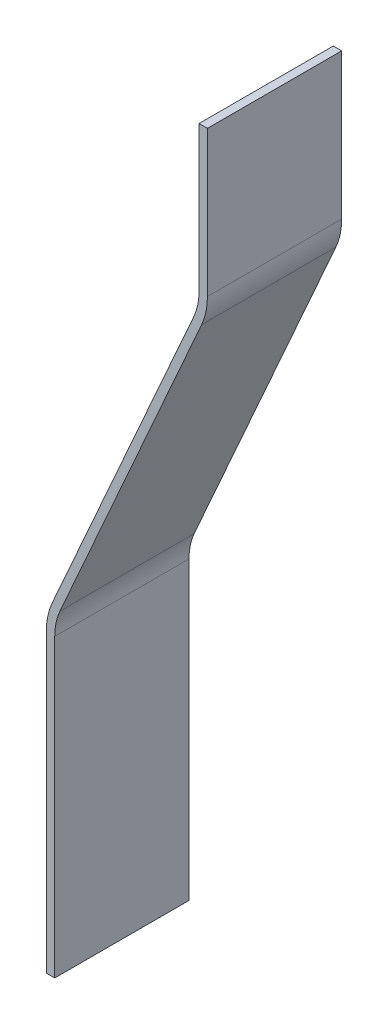
ISO-10303-21;
HEADER;
FILE_DESCRIPTION(('STEP AP214'),'2;1');
FILE_NAME('part.step','',(''),(''),'','','');
FILE_SCHEMA(('AUTOMOTIVE_DESIGN { 1 0 10303 214 1 1 1 1 }'));
ENDSEC;
DATA;
#1=APPLICATION_CONTEXT('core data for automotive mechanical design processes');
#2=APPLICATION_PROTOCOL_DEFINITION('international standard','automotive_design',2000,#1);
#3=PRODUCT_CONTEXT('',#1,'mechanical');
#4=PRODUCT('Part','Part','',(#3));
#5=PRODUCT_RELATED_PRODUCT_CATEGORY('part','',(#4));
#6=PRODUCT_DEFINITION_FORMATION('','',#4);
#7=PRODUCT_DEFINITION_CONTEXT('part definition',#1,'design');
#8=PRODUCT_DEFINITION('design','',#6,#7);
#9=PRODUCT_DEFINITION_SHAPE('','',#8);
#10=(LENGTH_UNIT() NAMED_UNIT(*) SI_UNIT(.MILLI.,.METRE.));
#11=(NAMED_UNIT(*) PLANE_ANGLE_UNIT() SI_UNIT($,.RADIAN.));
#12=(NAMED_UNIT(*) SI_UNIT($,.STERADIAN.) SOLID_ANGLE_UNIT());
#13=UNCERTAINTY_MEASURE_WITH_UNIT(LENGTH_MEASURE(1.E-05),#10,'distance_accuracy_value','');
#14=(GEOMETRIC_REPRESENTATION_CONTEXT(3) GLOBAL_UNCERTAINTY_ASSIGNED_CONTEXT((#13)) GLOBAL_UNIT_ASSIGNED_CONTEXT((#10,
#11,#12)) REPRESENTATION_CONTEXT('',''));
#15=CARTESIAN_POINT('',(0.,0.,0.));
#16=DIRECTION('',(0.,0.,1.));
#17=DIRECTION('',(1.,0.,0.));
#18=AXIS2_PLACEMENT_3D('',#15,#16,#17);
#19=CARTESIAN_POINT('',(0.,-234.95,101.6));
#20=DIRECTION('',(0.,1.,0.));
#21=DIRECTION('',(0.,0.,1.));
#22=AXIS2_PLACEMENT_3D('',#19,#20,#21);
#23=PLANE('',#22);
#24=DIRECTION('',(1.,0.,0.));
#25=VECTOR('',#24,1.);
#26=CARTESIAN_POINT('',(0.,-234.95,0.));
#27=LINE('',#26,#25);
#28=CARTESIAN_POINT('',(0.,-234.95,0.));
#29=VERTEX_POINT('',#28);
#30=CARTESIAN_POINT('',(6.35000000000003,-234.95,0.));
#31=VERTEX_POINT('',#30);
#32=EDGE_CURVE('E169',#29,#31,#27,.T.);
#33=ORIENTED_EDGE('',*,*,#32,.T.);
#34=DIRECTION('',(0.,0.,-1.));
#35=VECTOR('',#34,1.);
#36=CARTESIAN_POINT('',(6.35000000000003,-234.95,101.6));
#37=LINE('',#36,#35);
#38=CARTESIAN_POINT('',(6.35000000000003,-234.95,101.6));
#39=VERTEX_POINT('',#38);
#40=EDGE_CURVE('E11',#39,#31,#37,.T.);
#41=ORIENTED_EDGE('',*,*,#40,.F.);
#42=DIRECTION('',(1.,0.,0.));
#43=VECTOR('',#42,1.);
#44=CARTESIAN_POINT('',(0.,-234.95,101.6));
#45=LINE('',#44,#43);
#46=CARTESIAN_POINT('',(0.,-234.95,101.6));
#47=VERTEX_POINT('',#46);
#48=EDGE_CURVE('E203',#47,#39,#45,.T.);
#49=ORIENTED_EDGE('',*,*,#48,.F.);
#50=DIRECTION('',(0.,0.,-1.));
#51=VECTOR('',#50,1.);
#52=CARTESIAN_POINT('',(0.,-234.95,101.6));
#53=LINE('',#52,#51);
#54=EDGE_CURVE('E165',#47,#29,#53,.T.);
#55=ORIENTED_EDGE('',*,*,#54,.T.);
#56=EDGE_LOOP('',(#33,#41,#49,#55));
#57=FACE_BOUND('',#56,.T.);
#58=ADVANCED_FACE('F44',(#57),#23,.F.);
#59=CARTESIAN_POINT('',(6.35000000000003,-234.95,101.6));
#60=DIRECTION('',(-1.,0.,0.));
#61=DIRECTION('',(0.,-1.,0.));
#62=AXIS2_PLACEMENT_3D('',#59,#60,#61);
#63=PLANE('',#62);
#64=DIRECTION('',(0.,1.,0.));
#65=VECTOR('',#64,1.);
#66=CARTESIAN_POINT('',(6.35000000000003,-234.95,0.));
#67=LINE('',#66,#65);
#68=CARTESIAN_POINT('',(6.35000000000002,-11.046666411209,0.));
#69=VERTEX_POINT('',#68);
#70=EDGE_CURVE('E173',#31,#69,#67,.T.);
#71=ORIENTED_EDGE('',*,*,#70,.T.);
#72=DIRECTION('',(0.,0.,-1.));
#73=VECTOR('',#72,1.);
#74=CARTESIAN_POINT('',(6.35000000000002,-11.046666411209,101.6));
#75=LINE('',#74,#73);
#76=CARTESIAN_POINT('',(6.35000000000002,-11.046666411209,101.6));
#77=VERTEX_POINT('',#76);
#78=EDGE_CURVE('E53',#77,#69,#75,.T.);
#79=ORIENTED_EDGE('',*,*,#78,.F.);
#80=DIRECTION('',(0.,1.,0.));
#81=VECTOR('',#80,1.);
#82=CARTESIAN_POINT('',(6.35000000000003,-234.95,101.6));
#83=LINE('',#82,#81);
#84=EDGE_CURVE('E116',#39,#77,#83,.T.);
#85=ORIENTED_EDGE('',*,*,#84,.F.);
#86=ORIENTED_EDGE('',*,*,#40,.T.);
#87=EDGE_LOOP('',(#71,#79,#85,#86));
#88=FACE_BOUND('',#87,.T.);
#89=ADVANCED_FACE('F297',(#88),#63,.F.);
#90=CARTESIAN_POINT('',(52.07,-11.046666411209,101.6));
#91=DIRECTION('',(0.,0.,-1.));
#92=DIRECTION('',(-1.,0.,0.));
#93=AXIS2_PLACEMENT_3D('',#90,#91,#92);
#94=CYLINDRICAL_SURFACE('',#93,45.72);
#95=CARTESIAN_POINT('',(52.07,-11.046666411209,0.));
#96=DIRECTION('',(0.,0.,-1.));
#97=DIRECTION('',(-1.,0.,0.));
#98=AXIS2_PLACEMENT_3D('',#95,#96,#97);
#99=CIRCLE('',#98,45.72);
#100=CARTESIAN_POINT('',(10.2882567723137,7.51685515275333,0.));
#101=VERTEX_POINT('',#100);
#102=EDGE_CURVE('E176',#69,#101,#99,.T.);
#103=ORIENTED_EDGE('',*,*,#102,.T.);
#104=DIRECTION('',(0.,0.,-1.));
#105=VECTOR('',#104,1.);
#106=CARTESIAN_POINT('',(10.2882567723137,7.51685515275333,101.6));
#107=LINE('',#106,#105);
#108=CARTESIAN_POINT('',(10.2882567723137,7.51685515275333,101.6));
#109=VERTEX_POINT('',#108);
#110=EDGE_CURVE('E230',#109,#101,#107,.T.);
#111=ORIENTED_EDGE('',*,*,#110,.F.);
#112=CARTESIAN_POINT('',(52.07,-11.046666411209,101.6));
#113=DIRECTION('',(0.,0.,-1.));
#114=DIRECTION('',(-1.,0.,0.));
#115=AXIS2_PLACEMENT_3D('',#112,#113,#114);
#116=CIRCLE('',#115,45.72);
#117=EDGE_CURVE('E240',#77,#109,#116,.T.);
#118=ORIENTED_EDGE('',*,*,#117,.F.);
#119=ORIENTED_EDGE('',*,*,#78,.T.);
#120=EDGE_LOOP('',(#103,#111,#118,#119));
#121=FACE_BOUND('',#120,.T.);
#122=ADVANCED_FACE('F238',(#121),#94,.F.);
#123=CARTESIAN_POINT('',(10.2882567723137,7.51685515275333,101.6));
#124=DIRECTION('',(-0.913861400430583,0.406026280926559,0.));
#125=DIRECTION('',(-0.40602628092656,-0.913861400430583,0.));
#126=AXIS2_PLACEMENT_3D('',#123,#124,#125);
#127=PLANE('',#126);
#128=DIRECTION('',(0.406026280926559,0.913861400430583,0.));
#129=VECTOR('',#128,1.);
#130=CARTESIAN_POINT('',(10.2882567723137,7.51685515275333,0.));
#131=LINE('',#130,#129);
#132=CARTESIAN_POINT('',(117.544159141874,248.922482690496,0.));
#133=VERTEX_POINT('',#132);
#134=EDGE_CURVE('E179',#101,#133,#131,.T.);
#135=ORIENTED_EDGE('',*,*,#134,.T.);
#136=DIRECTION('',(0.,0.,-1.));
#137=VECTOR('',#136,1.);
#138=CARTESIAN_POINT('',(117.544159141874,248.922482690496,101.6));
#139=LINE('',#138,#137);
#140=CARTESIAN_POINT('',(117.544159141874,248.922482690496,101.6));
#141=VERTEX_POINT('',#140);
#142=EDGE_CURVE('E226',#141,#133,#139,.T.);
#143=ORIENTED_EDGE('',*,*,#142,.F.);
#144=DIRECTION('',(0.406026280926559,0.913861400430583,0.));
#145=VECTOR('',#144,1.);
#146=CARTESIAN_POINT('',(10.2882567723137,7.51685515275333,101.6));
#147=LINE('',#146,#145);
#148=EDGE_CURVE('E259',#109,#141,#147,.T.);
#149=ORIENTED_EDGE('',*,*,#148,.F.);
#150=ORIENTED_EDGE('',*,*,#110,.T.);
#151=EDGE_LOOP('',(#135,#143,#149,#150));
#152=FACE_BOUND('',#151,.T.);
#153=ADVANCED_FACE('F249',(#152),#127,.F.);
#154=CARTESIAN_POINT('',(71.12,269.548617761565,101.6));
#155=DIRECTION('',(0.,0.,-1.));
#156=DIRECTION('',(-1.,0.,0.));
#157=AXIS2_PLACEMENT_3D('',#154,#155,#156);
#158=CYLINDRICAL_SURFACE('',#157,50.8);
#159=CARTESIAN_POINT('',(71.12,269.548617761565,0.));
#160=DIRECTION('',(0.,0.,1.));
#161=DIRECTION('',(1.,0.,0.));
#162=AXIS2_PLACEMENT_3D('',#159,#160,#161);
#163=CIRCLE('',#162,50.8);
#164=CARTESIAN_POINT('',(121.92,269.548617761565,0.));
#165=VERTEX_POINT('',#164);
#166=EDGE_CURVE('E182',#133,#165,#163,.T.);
#167=ORIENTED_EDGE('',*,*,#166,.T.);
#168=DIRECTION('',(0.,0.,-1.));
#169=VECTOR('',#168,1.);
#170=CARTESIAN_POINT('',(121.92,269.548617761565,101.6));
#171=LINE('',#170,#169);
#172=CARTESIAN_POINT('',(121.92,269.548617761565,101.6));
#173=VERTEX_POINT('',#172);
#174=EDGE_CURVE('E222',#173,#165,#171,.T.);
#175=ORIENTED_EDGE('',*,*,#174,.F.);
#176=CARTESIAN_POINT('',(71.12,269.548617761565,101.6));
#177=DIRECTION('',(0.,0.,1.));
#178=DIRECTION('',(1.,0.,0.));
#179=AXIS2_PLACEMENT_3D('',#176,#177,#178);
#180=CIRCLE('',#179,50.8);
#181=EDGE_CURVE('E255',#141,#173,#180,.T.);
#182=ORIENTED_EDGE('',*,*,#181,.F.);
#183=ORIENTED_EDGE('',*,*,#142,.T.);
#184=EDGE_LOOP('',(#167,#175,#182,#183));
#185=FACE_BOUND('',#184,.T.);
#186=ADVANCED_FACE('F253',(#185),#158,.T.);
#187=CARTESIAN_POINT('',(121.92,269.548617761565,101.6));
#188=DIRECTION('',(-1.,0.,0.));
#189=DIRECTION('',(0.,0.,1.));
#190=AXIS2_PLACEMENT_3D('',#187,#188,#189);
#191=PLANE('',#190);
#192=DIRECTION('',(0.,1.,0.));
#193=VECTOR('',#192,1.);
#194=CARTESIAN_POINT('',(121.92,269.548617761565,0.));
#195=LINE('',#194,#193);
#196=CARTESIAN_POINT('',(121.92,379.784617761565,0.));
#197=VERTEX_POINT('',#196);
#198=EDGE_CURVE('E185',#165,#197,#195,.T.);
#199=ORIENTED_EDGE('',*,*,#198,.T.);
#200=DIRECTION('',(0.,0.,-1.));
#201=VECTOR('',#200,1.);
#202=CARTESIAN_POINT('',(121.92,379.784617761565,101.6));
#203=LINE('',#202,#201);
#204=CARTESIAN_POINT('',(121.92,379.784617761565,101.6));
#205=VERTEX_POINT('',#204);
#206=EDGE_CURVE('E218',#205,#197,#203,.T.);
#207=ORIENTED_EDGE('',*,*,#206,.F.);
#208=DIRECTION('',(0.,1.,0.));
#209=VECTOR('',#208,1.);
#210=CARTESIAN_POINT('',(121.92,269.548617761565,101.6));
#211=LINE('',#210,#209);
#212=EDGE_CURVE('E258',#173,#205,#211,.T.);
#213=ORIENTED_EDGE('',*,*,#212,.F.);
#214=ORIENTED_EDGE('',*,*,#174,.T.);
#215=EDGE_LOOP('',(#199,#207,#213,#214));
#216=FACE_BOUND('',#215,.T.);
#217=ADVANCED_FACE('F310',(#216),#191,.F.);
#218=CARTESIAN_POINT('',(115.57,379.784617761565,101.6));
#219=DIRECTION('',(0.,-1.,0.));
#220=DIRECTION('',(0.,0.,-1.));
#221=AXIS2_PLACEMENT_3D('',#218,#219,#220);
#222=PLANE('',#221);
#223=DIRECTION('',(-1.,0.,0.));
#224=VECTOR('',#223,1.);
#225=CARTESIAN_POINT('',(115.57,379.784617761565,0.));
#226=LINE('',#225,#224);
#227=CARTESIAN_POINT('',(115.57,379.784617761565,0.));
#228=VERTEX_POINT('',#227);
#229=EDGE_CURVE('E188',#197,#228,#226,.T.);
#230=ORIENTED_EDGE('',*,*,#229,.T.);
#231=DIRECTION('',(0.,0.,-1.));
#232=VECTOR('',#231,1.);
#233=CARTESIAN_POINT('',(115.57,379.784617761565,101.6));
#234=LINE('',#233,#232);
#235=CARTESIAN_POINT('',(115.57,379.784617761565,101.6));
#236=VERTEX_POINT('',#235);
#237=EDGE_CURVE('E214',#236,#228,#234,.T.);
#238=ORIENTED_EDGE('',*,*,#237,.F.);
#239=DIRECTION('',(-1.,0.,0.));
#240=VECTOR('',#239,1.);
#241=CARTESIAN_POINT('',(115.57,379.784617761565,101.6));
#242=LINE('',#241,#240);
#243=EDGE_CURVE('E263',#205,#236,#242,.T.);
#244=ORIENTED_EDGE('',*,*,#243,.F.);
#245=ORIENTED_EDGE('',*,*,#206,.T.);
#246=EDGE_LOOP('',(#230,#238,#244,#245));
#247=FACE_BOUND('',#246,.T.);
#248=ADVANCED_FACE('F313',(#247),#222,.F.);
#249=CARTESIAN_POINT('',(115.57,269.818048649644,101.6));
#250=DIRECTION('',(1.,0.,0.));
#251=DIRECTION('',(0.,1.,0.));
#252=AXIS2_PLACEMENT_3D('',#249,#250,#251);
#253=PLANE('',#252);
#254=DIRECTION('',(0.,-1.,0.));
#255=VECTOR('',#254,1.);
#256=CARTESIAN_POINT('',(115.57,269.818048649644,0.));
#257=LINE('',#256,#255);
#258=CARTESIAN_POINT('',(115.57,269.818048649644,0.));
#259=VERTEX_POINT('',#258);
#260=EDGE_CURVE('E191',#228,#259,#257,.T.);
#261=ORIENTED_EDGE('',*,*,#260,.T.);
#262=DIRECTION('',(0.,0.,-1.));
#263=VECTOR('',#262,1.);
#264=CARTESIAN_POINT('',(115.57,269.818048649644,101.6));
#265=LINE('',#264,#263);
#266=CARTESIAN_POINT('',(115.57,269.818048649644,101.6));
#267=VERTEX_POINT('',#266);
#268=EDGE_CURVE('E210',#267,#259,#265,.T.);
#269=ORIENTED_EDGE('',*,*,#268,.F.);
#270=DIRECTION('',(0.,-1.,0.));
#271=VECTOR('',#270,1.);
#272=CARTESIAN_POINT('',(115.57,269.818048649644,101.6));
#273=LINE('',#272,#271);
#274=EDGE_CURVE('E270',#236,#267,#273,.T.);
#275=ORIENTED_EDGE('',*,*,#274,.F.);
#276=ORIENTED_EDGE('',*,*,#237,.T.);
#277=EDGE_LOOP('',(#261,#269,#275,#276));
#278=FACE_BOUND('',#277,.T.);
#279=ADVANCED_FACE('F278',(#278),#253,.F.);
#280=CARTESIAN_POINT('',(69.85,269.818048649644,101.6));
#281=DIRECTION('',(0.,0.,-1.));
#282=DIRECTION('',(-1.,0.,0.));
#283=AXIS2_PLACEMENT_3D('',#280,#281,#282);
#284=CYLINDRICAL_SURFACE('',#283,45.72);
#285=CARTESIAN_POINT('',(69.85,269.818048649644,0.));
#286=DIRECTION('',(0.,0.,-1.));
#287=DIRECTION('',(-1.,0.,0.));
#288=AXIS2_PLACEMENT_3D('',#285,#286,#287);
#289=CIRCLE('',#288,45.72);
#290=CARTESIAN_POINT('',(111.631743227686,251.254527085681,0.));
#291=VERTEX_POINT('',#290);
#292=EDGE_CURVE('E194',#259,#291,#289,.T.);
#293=ORIENTED_EDGE('',*,*,#292,.T.);
#294=DIRECTION('',(0.,0.,-1.));
#295=VECTOR('',#294,1.);
#296=CARTESIAN_POINT('',(111.631743227686,251.254527085681,101.6));
#297=LINE('',#296,#295);
#298=CARTESIAN_POINT('',(111.631743227686,251.254527085681,101.6));
#299=VERTEX_POINT('',#298);
#300=EDGE_CURVE('E158',#299,#291,#297,.T.);
#301=ORIENTED_EDGE('',*,*,#300,.F.);
#302=CARTESIAN_POINT('',(69.85,269.818048649644,101.6));
#303=DIRECTION('',(0.,0.,-1.));
#304=DIRECTION('',(-1.,0.,0.));
#305=AXIS2_PLACEMENT_3D('',#302,#303,#304);
#306=CIRCLE('',#305,45.72);
#307=EDGE_CURVE('E147',#267,#299,#306,.T.);
#308=ORIENTED_EDGE('',*,*,#307,.F.);
#309=ORIENTED_EDGE('',*,*,#268,.T.);
#310=EDGE_LOOP('',(#293,#301,#308,#309));
#311=FACE_BOUND('',#310,.T.);
#312=ADVANCED_FACE('F282',(#311),#284,.F.);
#313=CARTESIAN_POINT('',(4.37584085812638,9.84889954793848,101.6));
#314=DIRECTION('',(0.913861400430583,-0.406026280926559,0.));
#315=DIRECTION('',(0.406026280926559,0.913861400430583,0.));
#316=AXIS2_PLACEMENT_3D('',#313,#314,#315);
#317=PLANE('',#316);
#318=DIRECTION('',(-0.406026280926559,-0.913861400430583,0.));
#319=VECTOR('',#318,1.);
#320=CARTESIAN_POINT('',(4.37584085812638,9.84889954793848,0.));
#321=LINE('',#320,#319);
#322=CARTESIAN_POINT('',(4.37584085812637,9.84889954793848,0.));
#323=VERTEX_POINT('',#322);
#324=EDGE_CURVE('E156',#291,#323,#321,.T.);
#325=ORIENTED_EDGE('',*,*,#324,.T.);
#326=DIRECTION('',(0.,0.,-1.));
#327=VECTOR('',#326,1.);
#328=CARTESIAN_POINT('',(4.37584085812637,9.84889954793848,101.6));
#329=LINE('',#328,#327);
#330=CARTESIAN_POINT('',(4.37584085812637,9.84889954793848,101.6));
#331=VERTEX_POINT('',#330);
#332=EDGE_CURVE('E153',#331,#323,#329,.T.);
#333=ORIENTED_EDGE('',*,*,#332,.F.);
#334=DIRECTION('',(-0.406026280926559,-0.913861400430583,0.));
#335=VECTOR('',#334,1.);
#336=CARTESIAN_POINT('',(4.37584085812638,9.84889954793848,101.6));
#337=LINE('',#336,#335);
#338=EDGE_CURVE('E141',#299,#331,#337,.T.);
#339=ORIENTED_EDGE('',*,*,#338,.F.);
#340=ORIENTED_EDGE('',*,*,#300,.T.);
#341=EDGE_LOOP('',(#325,#333,#339,#340));
#342=FACE_BOUND('',#341,.T.);
#343=ADVANCED_FACE('F154',(#342),#317,.F.);
#344=CARTESIAN_POINT('',(50.8,-10.7772355231307,101.6));
#345=DIRECTION('',(0.,0.,-1.));
#346=DIRECTION('',(-1.,0.,0.));
#347=AXIS2_PLACEMENT_3D('',#344,#345,#346);
#348=CYLINDRICAL_SURFACE('',#347,50.8);
#349=CARTESIAN_POINT('',(50.8,-10.7772355231307,0.));
#350=DIRECTION('',(0.,0.,1.));
#351=DIRECTION('',(-1.,0.,0.));
#352=AXIS2_PLACEMENT_3D('',#349,#350,#351);
#353=CIRCLE('',#352,50.8);
#354=CARTESIAN_POINT('',(0.,-10.7772355231307,0.));
#355=VERTEX_POINT('',#354);
#356=EDGE_CURVE('E102',#323,#355,#353,.T.);
#357=ORIENTED_EDGE('',*,*,#356,.T.);
#358=DIRECTION('',(0.,0.,-1.));
#359=VECTOR('',#358,1.);
#360=CARTESIAN_POINT('',(0.,-10.7772355231307,101.6));
#361=LINE('',#360,#359);
#362=CARTESIAN_POINT('',(0.,-10.7772355231307,101.6));
#363=VERTEX_POINT('',#362);
#364=EDGE_CURVE('E159',#363,#355,#361,.T.);
#365=ORIENTED_EDGE('',*,*,#364,.F.);
#366=CARTESIAN_POINT('',(50.8,-10.7772355231307,101.6));
#367=DIRECTION('',(0.,0.,1.));
#368=DIRECTION('',(-1.,0.,0.));
#369=AXIS2_PLACEMENT_3D('',#366,#367,#368);
#370=CIRCLE('',#369,50.8);
#371=EDGE_CURVE('E145',#331,#363,#370,.T.);
#372=ORIENTED_EDGE('',*,*,#371,.F.);
#373=ORIENTED_EDGE('',*,*,#332,.T.);
#374=EDGE_LOOP('',(#357,#365,#372,#373));
#375=FACE_BOUND('',#374,.T.);
#376=ADVANCED_FACE('F161',(#375),#348,.T.);
#377=CARTESIAN_POINT('',(0.,-10.7772355231307,101.6));
#378=DIRECTION('',(1.,0.,0.));
#379=DIRECTION('',(0.,1.,0.));
#380=AXIS2_PLACEMENT_3D('',#377,#378,#379);
#381=PLANE('',#380);
#382=DIRECTION('',(0.,-1.,0.));
#383=VECTOR('',#382,1.);
#384=CARTESIAN_POINT('',(0.,-10.7772355231307,0.));
#385=LINE('',#384,#383);
#386=EDGE_CURVE('E108',#355,#29,#385,.T.);
#387=ORIENTED_EDGE('',*,*,#386,.T.);
#388=ORIENTED_EDGE('',*,*,#54,.F.);
#389=DIRECTION('',(0.,-1.,0.));
#390=VECTOR('',#389,1.);
#391=CARTESIAN_POINT('',(0.,-10.7772355231307,101.6));
#392=LINE('',#391,#390);
#393=EDGE_CURVE('E61',#363,#47,#392,.T.);
#394=ORIENTED_EDGE('',*,*,#393,.F.);
#395=ORIENTED_EDGE('',*,*,#364,.T.);
#396=EDGE_LOOP('',(#387,#388,#394,#395));
#397=FACE_BOUND('',#396,.T.);
#398=ADVANCED_FACE('F286',(#397),#381,.F.);
#399=CARTESIAN_POINT('',(52.07,-11.046666411209,101.6));
#400=DIRECTION('',(0.,0.,-1.));
#401=DIRECTION('',(-1.,0.,0.));
#402=AXIS2_PLACEMENT_3D('',#399,#400,#401);
#403=PLANE('',#402);
#404=ORIENTED_EDGE('',*,*,#48,.T.);
#405=ORIENTED_EDGE('',*,*,#84,.T.);
#406=ORIENTED_EDGE('',*,*,#117,.T.);
#407=ORIENTED_EDGE('',*,*,#148,.T.);
#408=ORIENTED_EDGE('',*,*,#181,.T.);
#409=ORIENTED_EDGE('',*,*,#212,.T.);
#410=ORIENTED_EDGE('',*,*,#243,.T.);
#411=ORIENTED_EDGE('',*,*,#274,.T.);
#412=ORIENTED_EDGE('',*,*,#307,.T.);
#413=ORIENTED_EDGE('',*,*,#338,.T.);
#414=ORIENTED_EDGE('',*,*,#371,.T.);
#415=ORIENTED_EDGE('',*,*,#393,.T.);
#416=EDGE_LOOP('',(#404,#405,#406,#407,#408,#409,#410,#411,#412,#413,#414,#415));
#417=FACE_BOUND('',#416,.T.);
#418=ADVANCED_FACE('F143',(#417),#403,.F.);
#419=CARTESIAN_POINT('',(52.07,-11.046666411209,0.));
#420=DIRECTION('',(0.,0.,-1.));
#421=DIRECTION('',(-1.,0.,0.));
#422=AXIS2_PLACEMENT_3D('',#419,#420,#421);
#423=PLANE('',#422);
#424=ORIENTED_EDGE('',*,*,#32,.F.);
#425=ORIENTED_EDGE('',*,*,#386,.F.);
#426=ORIENTED_EDGE('',*,*,#356,.F.);
#427=ORIENTED_EDGE('',*,*,#324,.F.);
#428=ORIENTED_EDGE('',*,*,#292,.F.);
#429=ORIENTED_EDGE('',*,*,#260,.F.);
#430=ORIENTED_EDGE('',*,*,#229,.F.);
#431=ORIENTED_EDGE('',*,*,#198,.F.);
#432=ORIENTED_EDGE('',*,*,#166,.F.);
#433=ORIENTED_EDGE('',*,*,#134,.F.);
#434=ORIENTED_EDGE('',*,*,#102,.F.);
#435=ORIENTED_EDGE('',*,*,#70,.F.);
#436=EDGE_LOOP('',(#424,#425,#426,#427,#428,#429,#430,#431,#432,#433,#434,#435));
#437=FACE_BOUND('',#436,.T.);
#438=ADVANCED_FACE('F244',(#437),#423,.T.);
#439=CLOSED_SHELL('',(#58,#89,#122,#153,#186,#217,#248,#279,#312,#343,#376,#398,#418,#438));
#440=MANIFOLD_SOLID_BREP('B2',#439);
#441=ADVANCED_BREP_SHAPE_REPRESENTATION('',(#18,#440),#14);
#442=SHAPE_DEFINITION_REPRESENTATION(#9,#441);
ENDSEC;
END-ISO-10303-21;
